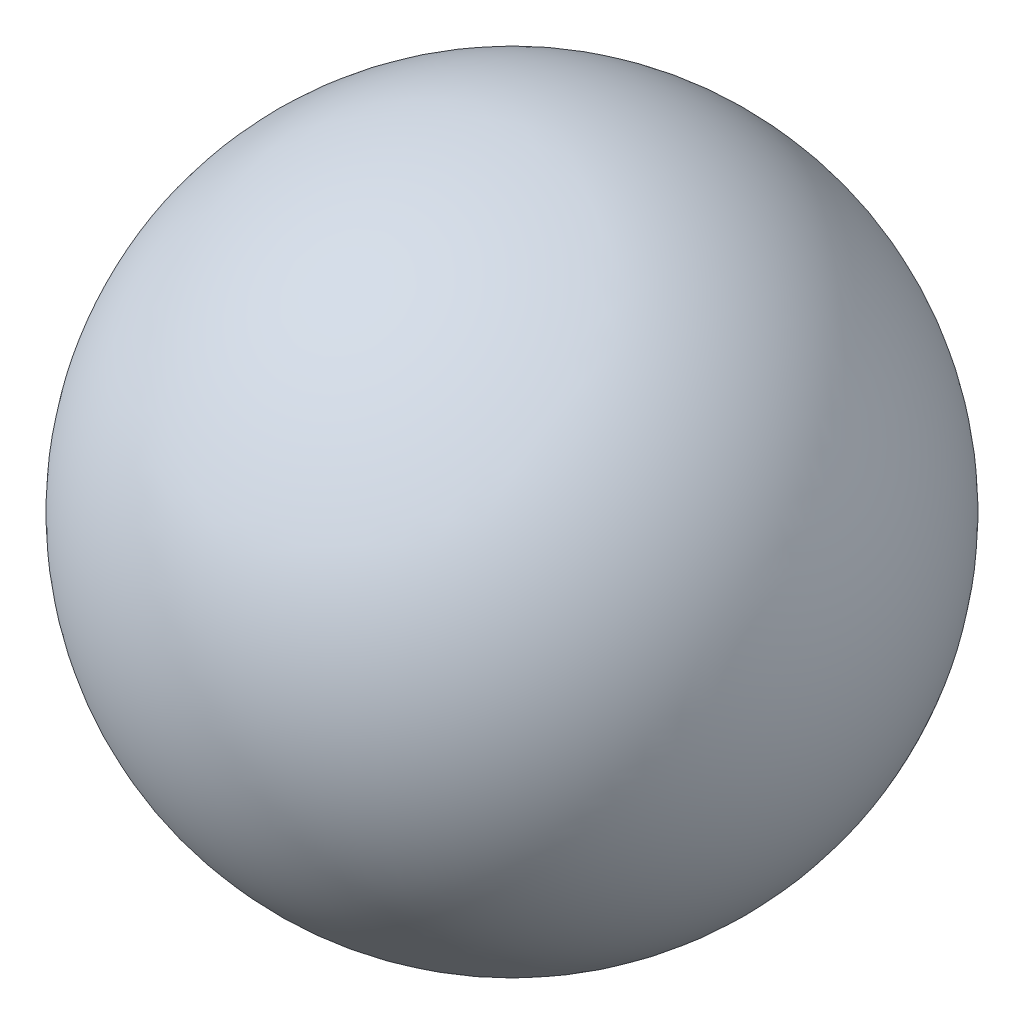
ISO-10303-21;
HEADER;
FILE_DESCRIPTION(('STEP AP214'),'2;1');
FILE_NAME('part.step','',(''),(''),'','','');
FILE_SCHEMA(('AUTOMOTIVE_DESIGN { 1 0 10303 214 1 1 1 1 }'));
ENDSEC;
DATA;
#1=APPLICATION_CONTEXT('core data for automotive mechanical design processes');
#2=APPLICATION_PROTOCOL_DEFINITION('international standard','automotive_design',2000,#1);
#3=PRODUCT_CONTEXT('',#1,'mechanical');
#4=PRODUCT('Part','Part','',(#3));
#5=PRODUCT_RELATED_PRODUCT_CATEGORY('part','',(#4));
#6=PRODUCT_DEFINITION_FORMATION('','',#4);
#7=PRODUCT_DEFINITION_CONTEXT('part definition',#1,'design');
#8=PRODUCT_DEFINITION('design','',#6,#7);
#9=PRODUCT_DEFINITION_SHAPE('','',#8);
#10=(LENGTH_UNIT() NAMED_UNIT(*) SI_UNIT(.MILLI.,.METRE.));
#11=(NAMED_UNIT(*) PLANE_ANGLE_UNIT() SI_UNIT($,.RADIAN.));
#12=(NAMED_UNIT(*) SI_UNIT($,.STERADIAN.) SOLID_ANGLE_UNIT());
#13=UNCERTAINTY_MEASURE_WITH_UNIT(LENGTH_MEASURE(1.E-05),#10,'distance_accuracy_value','');
#14=(GEOMETRIC_REPRESENTATION_CONTEXT(3) GLOBAL_UNCERTAINTY_ASSIGNED_CONTEXT((#13)) GLOBAL_UNIT_ASSIGNED_CONTEXT((#10,
#11,#12)) REPRESENTATION_CONTEXT('',''));
#15=CARTESIAN_POINT('',(0.,0.,0.));
#16=DIRECTION('',(0.,0.,1.));
#17=DIRECTION('',(1.,0.,0.));
#18=AXIS2_PLACEMENT_3D('',#15,#16,#17);
#19=CARTESIAN_POINT('',(0.,0.,0.));
#20=DIRECTION('',(0.,0.,-1.));
#21=DIRECTION('',(1.,0.,0.));
#22=AXIS2_PLACEMENT_3D('',#19,#20,#21);
#23=SPHERICAL_SURFACE('',#22,30.);
#24=CARTESIAN_POINT('',(0.,0.,0.));
#25=DIRECTION('',(1.,0.,0.));
#26=DIRECTION('',(0.,0.,-1.));
#27=AXIS2_PLACEMENT_3D('',#24,#25,#26);
#28=SPHERICAL_SURFACE('',#27,30.);
#29=CARTESIAN_POINT('',(-27.2717802865893,0.,0.));
#30=DIRECTION('',(1.,0.,0.));
#31=DIRECTION('',(0.,0.,-1.));
#32=AXIS2_PLACEMENT_3D('',#29,#30,#31);
#33=CIRCLE('',#32,12.5);
#34=CARTESIAN_POINT('',(-27.2717802865893,0.,-12.5));
#35=VERTEX_POINT('',#34);
#36=EDGE_CURVE('E10',#35,#35,#33,.T.);
#37=ORIENTED_EDGE('',*,*,#36,.T.);
#38=EDGE_LOOP('',(#37));
#39=FACE_BOUND('',#38,.T.);
#40=ADVANCED_FACE('F31',(#39),#28,.T.);
#41=CARTESIAN_POINT('',(-30.,0.,0.));
#42=DIRECTION('',(1.,0.,0.));
#43=DIRECTION('',(0.,0.,-1.));
#44=AXIS2_PLACEMENT_3D('',#41,#42,#43);
#45=CYLINDRICAL_SURFACE('',#44,12.5);
#46=CARTESIAN_POINT('',(0.,0.,0.));
#47=DIRECTION('',(1.,0.,0.));
#48=DIRECTION('',(0.,0.,-1.));
#49=AXIS2_PLACEMENT_3D('',#46,#47,#48);
#50=CIRCLE('',#49,12.5);
#51=CARTESIAN_POINT('',(0.,0.,-12.5));
#52=VERTEX_POINT('',#51);
#53=EDGE_CURVE('E37',#52,#52,#50,.T.);
#54=ORIENTED_EDGE('',*,*,#53,.T.);
#55=EDGE_LOOP('',(#54));
#56=FACE_BOUND('',#55,.T.);
#57=ORIENTED_EDGE('',*,*,#36,.F.);
#58=EDGE_LOOP('',(#57));
#59=FACE_BOUND('',#58,.T.);
#60=ADVANCED_FACE('F43',(#56,#59),#45,.F.);
#61=CARTESIAN_POINT('',(0.,0.,0.));
#62=DIRECTION('',(1.,0.,0.));
#63=DIRECTION('',(0.,0.,-1.));
#64=AXIS2_PLACEMENT_3D('',#61,#62,#63);
#65=PLANE('',#64);
#66=ORIENTED_EDGE('',*,*,#53,.F.);
#67=EDGE_LOOP('',(#66));
#68=FACE_BOUND('',#67,.T.);
#69=ADVANCED_FACE('F46',(#68),#65,.F.);
#70=CLOSED_SHELL('',(#40,#60,#69));
#71=MANIFOLD_SOLID_BREP('B2',#70);
#72=ADVANCED_BREP_SHAPE_REPRESENTATION('',(#18,#71),#14);
#73=SHAPE_DEFINITION_REPRESENTATION(#9,#72);
ENDSEC;
END-ISO-10303-21;
